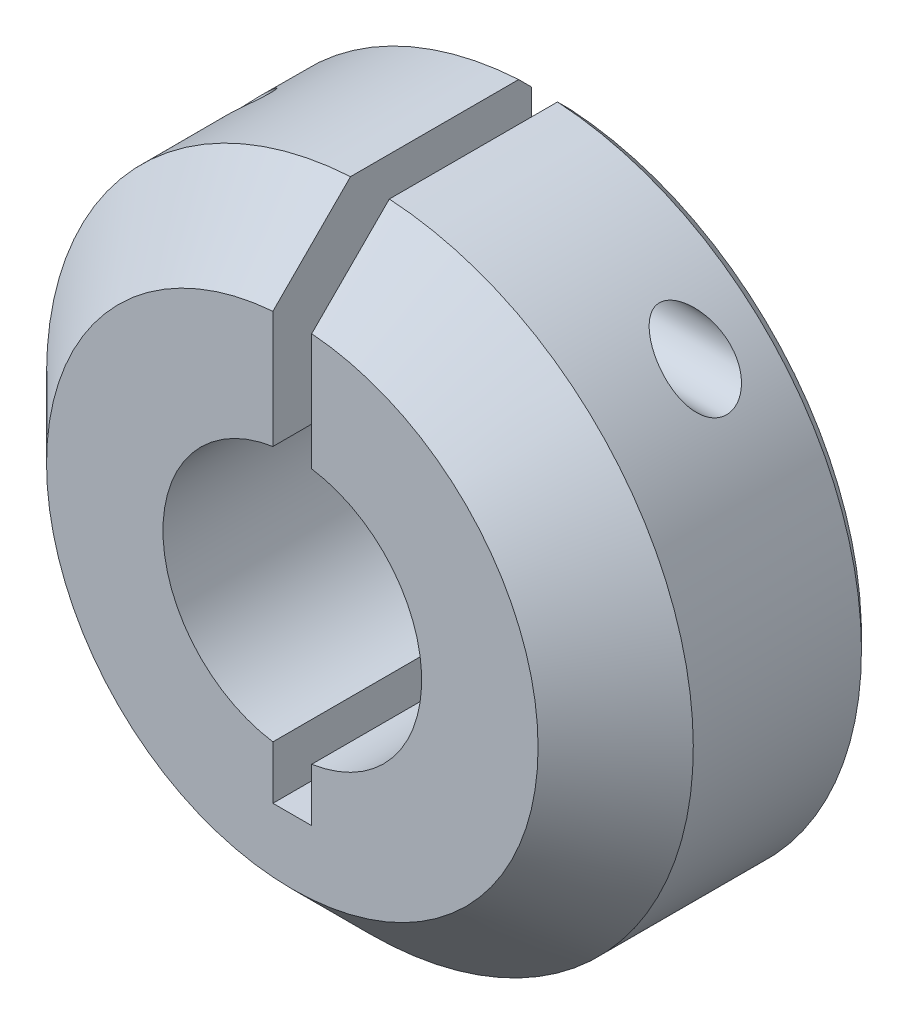
ISO-10303-21;
HEADER;
FILE_DESCRIPTION(('STEP AP214'),'2;1');
FILE_NAME('part.step','',(''),(''),'','','');
FILE_SCHEMA(('AUTOMOTIVE_DESIGN { 1 0 10303 214 1 1 1 1 }'));
ENDSEC;
DATA;
#1=APPLICATION_CONTEXT('core data for automotive mechanical design processes');
#2=APPLICATION_PROTOCOL_DEFINITION('international standard','automotive_design',2000,#1);
#3=PRODUCT_CONTEXT('',#1,'mechanical');
#4=PRODUCT('Part','Part','',(#3));
#5=PRODUCT_RELATED_PRODUCT_CATEGORY('part','',(#4));
#6=PRODUCT_DEFINITION_FORMATION('','',#4);
#7=PRODUCT_DEFINITION_CONTEXT('part definition',#1,'design');
#8=PRODUCT_DEFINITION('design','',#6,#7);
#9=PRODUCT_DEFINITION_SHAPE('','',#8);
#10=(LENGTH_UNIT() NAMED_UNIT(*) SI_UNIT(.MILLI.,.METRE.));
#11=(NAMED_UNIT(*) PLANE_ANGLE_UNIT() SI_UNIT($,.RADIAN.));
#12=(NAMED_UNIT(*) SI_UNIT($,.STERADIAN.) SOLID_ANGLE_UNIT());
#13=UNCERTAINTY_MEASURE_WITH_UNIT(LENGTH_MEASURE(1.E-05),#10,'distance_accuracy_value','');
#14=(GEOMETRIC_REPRESENTATION_CONTEXT(3) GLOBAL_UNCERTAINTY_ASSIGNED_CONTEXT((#13)) GLOBAL_UNIT_ASSIGNED_CONTEXT((#10,
#11,#12)) REPRESENTATION_CONTEXT('',''));
#15=CARTESIAN_POINT('',(0.,0.,0.));
#16=DIRECTION('',(0.,0.,1.));
#17=DIRECTION('',(1.,0.,0.));
#18=AXIS2_PLACEMENT_3D('',#15,#16,#17);
#19=CARTESIAN_POINT('',(0.,0.,10.));
#20=DIRECTION('',(0.,0.,-1.));
#21=DIRECTION('',(-1.,0.,0.));
#22=AXIS2_PLACEMENT_3D('',#19,#20,#21);
#23=CYLINDRICAL_SURFACE('',#22,5.);
#24=CARTESIAN_POINT('',(0.,0.,0.));
#25=DIRECTION('',(0.,0.,-1.));
#26=DIRECTION('',(1.,0.,0.));
#27=AXIS2_PLACEMENT_3D('',#24,#25,#26);
#28=CIRCLE('',#27,5.);
#29=CARTESIAN_POINT('',(0.750000000000001,4.9434299833213,0.));
#30=VERTEX_POINT('',#29);
#31=CARTESIAN_POINT('',(0.750000000000001,-4.9434299833213,0.));
#32=VERTEX_POINT('',#31);
#33=EDGE_CURVE('E137',#30,#32,#28,.T.);
#34=ORIENTED_EDGE('',*,*,#33,.T.);
#35=DIRECTION('',(0.,0.,-1.));
#36=VECTOR('',#35,1.);
#37=CARTESIAN_POINT('',(0.750000000000001,-4.9434299833213,10.));
#38=LINE('',#37,#36);
#39=CARTESIAN_POINT('',(0.750000000000001,-4.9434299833213,10.));
#40=VERTEX_POINT('',#39);
#41=EDGE_CURVE('E116',#40,#32,#38,.T.);
#42=ORIENTED_EDGE('',*,*,#41,.F.);
#43=CARTESIAN_POINT('',(0.,0.,10.));
#44=DIRECTION('',(0.,0.,-1.));
#45=DIRECTION('',(1.,0.,0.));
#46=AXIS2_PLACEMENT_3D('',#43,#44,#45);
#47=CIRCLE('',#46,5.);
#48=CARTESIAN_POINT('',(0.750000000000001,4.9434299833213,10.));
#49=VERTEX_POINT('',#48);
#50=EDGE_CURVE('E123',#49,#40,#47,.T.);
#51=ORIENTED_EDGE('',*,*,#50,.F.);
#52=DIRECTION('',(0.,0.,-1.));
#53=VECTOR('',#52,1.);
#54=CARTESIAN_POINT('',(0.750000000000001,4.9434299833213,10.));
#55=LINE('',#54,#53);
#56=EDGE_CURVE('E212',#49,#30,#55,.T.);
#57=ORIENTED_EDGE('',*,*,#56,.T.);
#58=EDGE_LOOP('',(#34,#42,#51,#57));
#59=FACE_BOUND('',#58,.T.);
#60=ADVANCED_FACE('F33',(#59),#23,.F.);
#61=CARTESIAN_POINT('',(0.750000000000001,-4.9434299833213,10.));
#62=DIRECTION('',(1.,0.,0.));
#63=DIRECTION('',(0.,1.,0.));
#64=AXIS2_PLACEMENT_3D('',#61,#62,#63);
#65=PLANE('',#64);
#66=DIRECTION('',(0.,-1.,0.));
#67=VECTOR('',#66,1.);
#68=CARTESIAN_POINT('',(0.750000000000001,-4.9434299833213,0.));
#69=LINE('',#68,#67);
#70=CARTESIAN_POINT('',(0.750000000000001,-7.,0.));
#71=VERTEX_POINT('',#70);
#72=EDGE_CURVE('E220',#32,#71,#69,.T.);
#73=ORIENTED_EDGE('',*,*,#72,.T.);
#74=DIRECTION('',(0.,0.,-1.));
#75=VECTOR('',#74,1.);
#76=CARTESIAN_POINT('',(0.750000000000001,-7.,10.));
#77=LINE('',#76,#75);
#78=CARTESIAN_POINT('',(0.750000000000001,-7.,10.));
#79=VERTEX_POINT('',#78);
#80=EDGE_CURVE('E119',#79,#71,#77,.T.);
#81=ORIENTED_EDGE('',*,*,#80,.F.);
#82=DIRECTION('',(0.,-1.,0.));
#83=VECTOR('',#82,1.);
#84=CARTESIAN_POINT('',(0.750000000000001,-4.9434299833213,10.));
#85=LINE('',#84,#83);
#86=EDGE_CURVE('E112',#40,#79,#85,.T.);
#87=ORIENTED_EDGE('',*,*,#86,.F.);
#88=ORIENTED_EDGE('',*,*,#41,.T.);
#89=EDGE_LOOP('',(#73,#81,#87,#88));
#90=FACE_BOUND('',#89,.T.);
#91=ADVANCED_FACE('F114',(#90),#65,.F.);
#92=CARTESIAN_POINT('',(-0.749999999999999,-7.,10.));
#93=DIRECTION('',(0.,-1.,0.));
#94=DIRECTION('',(0.,0.,-1.));
#95=AXIS2_PLACEMENT_3D('',#92,#93,#94);
#96=PLANE('',#95);
#97=DIRECTION('',(-1.,0.,0.));
#98=VECTOR('',#97,1.);
#99=CARTESIAN_POINT('',(-0.749999999999999,-7.,0.));
#100=LINE('',#99,#98);
#101=CARTESIAN_POINT('',(-0.749999999999999,-7.,0.));
#102=VERTEX_POINT('',#101);
#103=EDGE_CURVE('E222',#71,#102,#100,.T.);
#104=ORIENTED_EDGE('',*,*,#103,.T.);
#105=DIRECTION('',(0.,0.,-1.));
#106=VECTOR('',#105,1.);
#107=CARTESIAN_POINT('',(-0.749999999999999,-7.,10.));
#108=LINE('',#107,#106);
#109=CARTESIAN_POINT('',(-0.749999999999999,-7.,10.));
#110=VERTEX_POINT('',#109);
#111=EDGE_CURVE('E142',#110,#102,#108,.T.);
#112=ORIENTED_EDGE('',*,*,#111,.F.);
#113=DIRECTION('',(-1.,0.,0.));
#114=VECTOR('',#113,1.);
#115=CARTESIAN_POINT('',(-0.749999999999999,-7.,10.));
#116=LINE('',#115,#114);
#117=EDGE_CURVE('E122',#79,#110,#116,.T.);
#118=ORIENTED_EDGE('',*,*,#117,.F.);
#119=ORIENTED_EDGE('',*,*,#80,.T.);
#120=EDGE_LOOP('',(#104,#112,#118,#119));
#121=FACE_BOUND('',#120,.T.);
#122=ADVANCED_FACE('F263',(#121),#96,.F.);
#123=CARTESIAN_POINT('',(-0.749999999999999,-4.9434299833213,10.));
#124=DIRECTION('',(-1.,0.,0.));
#125=DIRECTION('',(0.,-1.,0.));
#126=AXIS2_PLACEMENT_3D('',#123,#124,#125);
#127=PLANE('',#126);
#128=DIRECTION('',(0.,1.,0.));
#129=VECTOR('',#128,1.);
#130=CARTESIAN_POINT('',(-0.749999999999999,-4.9434299833213,0.));
#131=LINE('',#130,#129);
#132=CARTESIAN_POINT('',(-0.750000000000003,-4.9434299833213,0.));
#133=VERTEX_POINT('',#132);
#134=EDGE_CURVE('E224',#102,#133,#131,.T.);
#135=ORIENTED_EDGE('',*,*,#134,.T.);
#136=DIRECTION('',(0.,0.,-1.));
#137=VECTOR('',#136,1.);
#138=CARTESIAN_POINT('',(-0.750000000000003,-4.9434299833213,10.));
#139=LINE('',#138,#137);
#140=CARTESIAN_POINT('',(-0.750000000000003,-4.9434299833213,10.));
#141=VERTEX_POINT('',#140);
#142=EDGE_CURVE('E234',#141,#133,#139,.T.);
#143=ORIENTED_EDGE('',*,*,#142,.F.);
#144=DIRECTION('',(0.,1.,0.));
#145=VECTOR('',#144,1.);
#146=CARTESIAN_POINT('',(-0.749999999999999,-4.9434299833213,10.));
#147=LINE('',#146,#145);
#148=EDGE_CURVE('E243',#110,#141,#147,.T.);
#149=ORIENTED_EDGE('',*,*,#148,.F.);
#150=ORIENTED_EDGE('',*,*,#111,.T.);
#151=EDGE_LOOP('',(#135,#143,#149,#150));
#152=FACE_BOUND('',#151,.T.);
#153=ADVANCED_FACE('F241',(#152),#127,.F.);
#154=CARTESIAN_POINT('',(0.,0.,10.));
#155=DIRECTION('',(0.,0.,-1.));
#156=DIRECTION('',(-1.,0.,0.));
#157=AXIS2_PLACEMENT_3D('',#154,#155,#156);
#158=CYLINDRICAL_SURFACE('',#157,5.);
#159=CARTESIAN_POINT('',(0.,0.,0.));
#160=DIRECTION('',(0.,0.,-1.));
#161=DIRECTION('',(1.,0.,0.));
#162=AXIS2_PLACEMENT_3D('',#159,#160,#161);
#163=CIRCLE('',#162,5.);
#164=CARTESIAN_POINT('',(-0.749999999999999,4.9434299833213,0.));
#165=VERTEX_POINT('',#164);
#166=EDGE_CURVE('E226',#133,#165,#163,.T.);
#167=ORIENTED_EDGE('',*,*,#166,.T.);
#168=DIRECTION('',(0.,0.,-1.));
#169=VECTOR('',#168,1.);
#170=CARTESIAN_POINT('',(-0.749999999999999,4.9434299833213,10.));
#171=LINE('',#170,#169);
#172=CARTESIAN_POINT('',(-0.749999999999999,4.9434299833213,10.));
#173=VERTEX_POINT('',#172);
#174=EDGE_CURVE('E208',#173,#165,#171,.T.);
#175=ORIENTED_EDGE('',*,*,#174,.F.);
#176=CARTESIAN_POINT('',(0.,0.,10.));
#177=DIRECTION('',(0.,0.,-1.));
#178=DIRECTION('',(1.,0.,0.));
#179=AXIS2_PLACEMENT_3D('',#176,#177,#178);
#180=CIRCLE('',#179,5.);
#181=EDGE_CURVE('E215',#141,#173,#180,.T.);
#182=ORIENTED_EDGE('',*,*,#181,.F.);
#183=ORIENTED_EDGE('',*,*,#142,.T.);
#184=EDGE_LOOP('',(#167,#175,#182,#183));
#185=FACE_BOUND('',#184,.T.);
#186=ADVANCED_FACE('F186',(#185),#158,.F.);
#187=CARTESIAN_POINT('',(-0.749999999999999,4.9434299833213,10.));
#188=DIRECTION('',(-1.,0.,0.));
#189=DIRECTION('',(0.,-1.,0.));
#190=AXIS2_PLACEMENT_3D('',#187,#188,#189);
#191=PLANE('',#190);
#192=CARTESIAN_POINT('',(-0.749999999999999,9.,3.));
#193=DIRECTION('',(-1.,0.,0.));
#194=DIRECTION('',(0.,-1.,0.));
#195=AXIS2_PLACEMENT_3D('',#192,#193,#194);
#196=CIRCLE('',#195,0.725);
#197=CARTESIAN_POINT('',(-0.749999999999999,8.275,3.));
#198=VERTEX_POINT('',#197);
#199=EDGE_CURVE('E356',#198,#198,#196,.T.);
#200=ORIENTED_EDGE('',*,*,#199,.T.);
#201=EDGE_LOOP('',(#200));
#202=FACE_BOUND('',#201,.T.);
#203=DIRECTION('',(0.,1.,0.));
#204=VECTOR('',#203,1.);
#205=CARTESIAN_POINT('',(-0.749999999999999,4.9434299833213,0.));
#206=LINE('',#205,#204);
#207=CARTESIAN_POINT('',(-0.749999999999999,11.9765395670035,0.));
#208=VERTEX_POINT('',#207);
#209=EDGE_CURVE('E228',#165,#208,#206,.T.);
#210=ORIENTED_EDGE('',*,*,#209,.T.);
#211=CARTESIAN_POINT('',(-0.749999999999999,11.9765395670035,0.));
#212=CARTESIAN_POINT('',(-0.749999999999999,12.0600327921926,0.0833301265377385));
#213=CARTESIAN_POINT('',(-0.749999999999999,12.1435244169929,0.166661856473588));
#214=CARTESIAN_POINT('',(-0.749999999999999,12.3105044658143,0.333328523140256));
#215=CARTESIAN_POINT('',(-0.749999999999999,12.3939928898355,0.416663459871074));
#216=CARTESIAN_POINT('',(-0.749999999999999,12.4774797134678,0.500000000000004));
#217=B_SPLINE_CURVE_WITH_KNOTS('',3,(#211,#212,#213,#214,#215,#216),.UNSPECIFIED.,.F.,.F.,(4,2,
4),(0.,0.353885938733081,0.707771877460835),.UNSPECIFIED.);
#218=CARTESIAN_POINT('',(-0.749999999999999,12.4774797134678,0.500000000000004));
#219=VERTEX_POINT('',#218);
#220=EDGE_CURVE('E11',#208,#219,#217,.T.);
#221=ORIENTED_EDGE('',*,*,#220,.T.);
#222=DIRECTION('',(0.,0.,-1.));
#223=VECTOR('',#222,1.);
#224=CARTESIAN_POINT('',(-0.749999999999999,12.4774797134678,10.));
#225=LINE('',#224,#223);
#226=CARTESIAN_POINT('',(-0.749999999999999,12.4774797134678,6.99999999999998));
#227=VERTEX_POINT('',#226);
#228=EDGE_CURVE('E203',#227,#219,#225,.T.);
#229=ORIENTED_EDGE('',*,*,#228,.F.);
#230=CARTESIAN_POINT('',(-0.749999999999999,12.4774797134678,6.99999999999998));
#231=CARTESIAN_POINT('',(-0.749999999999999,11.9764534394981,7.50016264999375));
#232=CARTESIAN_POINT('',(-0.749999999999999,11.4753460324942,8.00024397409326));
#233=CARTESIAN_POINT('',(-0.75,10.4729689488188,9.00024397409443));
#234=CARTESIAN_POINT('',(-0.75,9.97169927214604,9.50016264999493));
#235=CARTESIAN_POINT('',(-0.749999999999999,9.47034846243791,10.));
#236=B_SPLINE_CURVE_WITH_KNOTS('',3,(#230,#231,#232,#233,#234,#235),.UNSPECIFIED.,.F.,.F.,(4,2,
4),(0.,2.12384313841809,4.24768629208814),.UNSPECIFIED.);
#237=CARTESIAN_POINT('',(-0.749999999999999,9.4703484624379,10.));
#238=VERTEX_POINT('',#237);
#239=EDGE_CURVE('E190',#227,#238,#236,.T.);
#240=ORIENTED_EDGE('',*,*,#239,.T.);
#241=DIRECTION('',(0.,1.,0.));
#242=VECTOR('',#241,1.);
#243=CARTESIAN_POINT('',(-0.749999999999999,4.9434299833213,10.));
#244=LINE('',#243,#242);
#245=EDGE_CURVE('E211',#173,#238,#244,.T.);
#246=ORIENTED_EDGE('',*,*,#245,.F.);
#247=ORIENTED_EDGE('',*,*,#174,.T.);
#248=EDGE_LOOP('',(#210,#221,#229,#240,#246,#247));
#249=FACE_BOUND('',#248,.T.);
#250=ADVANCED_FACE('F182',(#202,#249),#191,.F.);
#251=CARTESIAN_POINT('',(0.,0.,10.));
#252=DIRECTION('',(0.,0.,-1.));
#253=DIRECTION('',(-1.,0.,0.));
#254=AXIS2_PLACEMENT_3D('',#251,#252,#253);
#255=CYLINDRICAL_SURFACE('',#254,12.5);
#256=CARTESIAN_POINT('',(-7.85330344504783,9.725,3.));
#257=CARTESIAN_POINT('',(-7.85330724966282,9.72499710166703,3.03049591517305));
#258=CARTESIAN_POINT('',(-7.85571767964799,9.72305192932455,3.06104722408714));
#259=CARTESIAN_POINT('',(-7.86508708886648,9.71547418285057,3.12100402933793));
#260=CARTESIAN_POINT('',(-7.87205932184832,9.70983086414133,3.1504059215886));
#261=CARTESIAN_POINT('',(-7.88974930812586,9.69546193886619,3.20687857289311));
#262=CARTESIAN_POINT('',(-7.90042811243029,9.68676837463444,3.23397005912363));
#263=CARTESIAN_POINT('',(-7.92474388514337,9.66688583469671,3.28576091243097));
#264=CARTESIAN_POINT('',(-7.93838121570186,9.65569655348811,3.31045998611943));
#265=CARTESIAN_POINT('',(-7.97589737590445,9.62475566155536,3.37008930555561));
#266=CARTESIAN_POINT('',(-8.00132779757763,9.60364489230904,3.40333418044508));
#267=CARTESIAN_POINT('',(-8.05564605484352,9.55812931500246,3.46429518527835));
#268=CARTESIAN_POINT('',(-8.08454349752005,9.53371532871557,3.49199535728557));
#269=CARTESIAN_POINT('',(-8.15938950174766,9.46983712499056,3.55476153792435));
#270=CARTESIAN_POINT('',(-8.20670337145852,9.42890066151729,3.58669612526895));
#271=CARTESIAN_POINT('',(-8.30376904511924,9.34353393390023,3.64043255352067));
#272=CARTESIAN_POINT('',(-8.35352338852479,9.2991000000703,3.662223581146));
#273=CARTESIAN_POINT('',(-8.45588916882334,9.20613318897957,3.69690939695554));
#274=CARTESIAN_POINT('',(-8.50853843078886,9.15750971063575,3.70944812371478));
#275=CARTESIAN_POINT('',(-8.61373339489862,9.05863168998092,3.72435203505037));
#276=CARTESIAN_POINT('',(-8.66627910839686,9.0083773384181,3.72671840510346));
#277=CARTESIAN_POINT('',(-8.76964682229392,8.90777424346779,3.72085532598516));
#278=CARTESIAN_POINT('',(-8.82048114474011,8.85743206191318,3.71273714850372));
#279=CARTESIAN_POINT('',(-8.91976173784721,8.75744183830774,3.68518198235305));
#280=CARTESIAN_POINT('',(-8.96821059177723,8.70779308902654,3.66575754347398));
#281=CARTESIAN_POINT('',(-9.04807825675744,8.62465252839502,3.62152777646508));
#282=CARTESIAN_POINT('',(-9.08048317150173,8.59051067874849,3.59972593807996));
#283=CARTESIAN_POINT('',(-9.14223986859575,8.52475633759282,3.54907672548391));
#284=CARTESIAN_POINT('',(-9.17159597381425,8.49314027989983,3.52023952656998));
#285=CARTESIAN_POINT('',(-9.21990080234129,8.4406402555048,3.46249795800548));
#286=CARTESIAN_POINT('',(-9.23970719667171,8.41893943109935,3.4350584539834));
#287=CARTESIAN_POINT('',(-9.27596766552569,8.3789706889845,3.37579290742236));
#288=CARTESIAN_POINT('',(-9.29242569965897,8.36069871848657,3.34397212156219));
#289=CARTESIAN_POINT('',(-9.31870774270352,8.33138694795417,3.28204653366979));
#290=CARTESIAN_POINT('',(-9.32918165237736,8.31964795424696,3.25255071288326));
#291=CARTESIAN_POINT('',(-9.3466947114695,8.29996822792607,3.19134174893574));
#292=CARTESIAN_POINT('',(-9.35373564887537,8.29202551814461,3.15962976987314));
#293=CARTESIAN_POINT('',(-9.36398884546344,8.28044532273691,3.09465455435827));
#294=CARTESIAN_POINT('',(-9.36718281394162,8.27682840498238,3.06138468239037));
#295=CARTESIAN_POINT('',(-9.36946061550331,8.27424989932699,2.99452524668271));
#296=CARTESIAN_POINT('',(-9.36854534560874,8.27528729541751,2.96093575431157));
#297=CARTESIAN_POINT('',(-9.36291135910865,8.28166079836362,2.89726124814134));
#298=CARTESIAN_POINT('',(-9.35850438569938,8.286644549488,2.86711161634526));
#299=CARTESIAN_POINT('',(-9.34652268548436,8.30015629540967,2.8082837809095));
#300=CARTESIAN_POINT('',(-9.3389477136398,8.30868456436854,2.77960569128355));
#301=CARTESIAN_POINT('',(-9.32058383649283,8.32928053236343,2.72303854263531));
#302=CARTESIAN_POINT('',(-9.30966428469156,8.34149172337805,2.69524488274574));
#303=CARTESIAN_POINT('',(-9.28522749986691,8.36868480237186,2.64229349023903));
#304=CARTESIAN_POINT('',(-9.27170880026225,8.38366825443163,2.61713725824581));
#305=CARTESIAN_POINT('',(-9.23576183598183,8.42328347489762,2.55865953619397));
#306=CARTESIAN_POINT('',(-9.21210417587027,8.44917306964944,2.5269407735812));
#307=CARTESIAN_POINT('',(-9.16137693091012,8.50415085386506,2.46958066790138));
#308=CARTESIAN_POINT('',(-9.13430017893837,8.53324574545813,2.44395242688183));
#309=CARTESIAN_POINT('',(-9.06774717178811,8.60401400992665,2.39056343180605));
#310=CARTESIAN_POINT('',(-9.02724754221942,8.64652626220679,2.36519467130258));
#311=CARTESIAN_POINT('',(-8.94335908696782,8.73326940513997,2.32413885814293));
#312=CARTESIAN_POINT('',(-8.89996677569394,8.77750234143882,2.30846372844709));
#313=CARTESIAN_POINT('',(-8.79884860484494,8.87900466426493,2.28274900273685));
#314=CARTESIAN_POINT('',(-8.74054284913965,8.93641932653513,2.27556144255526));
#315=CARTESIAN_POINT('',(-8.62269197986944,9.05018892381536,2.27450039416114));
#316=CARTESIAN_POINT('',(-8.56314487661866,9.10654182923619,2.28065021948222));
#317=CARTESIAN_POINT('',(-8.44382522571382,9.21729425149788,2.30597417354877));
#318=CARTESIAN_POINT('',(-8.38405675250525,9.2716674244989,2.32528281525728));
#319=CARTESIAN_POINT('',(-8.2669294158327,9.37624559331403,2.3775245537631));
#320=CARTESIAN_POINT('',(-8.2095641037396,9.42646215125229,2.41041822073855));
#321=CARTESIAN_POINT('',(-8.12486804904238,9.4993751853022,2.47329304866909));
#322=CARTESIAN_POINT('',(-8.09556564699048,9.52434621338786,2.49801401906077));
#323=CARTESIAN_POINT('',(-8.03963614062611,9.57160265826435,2.55256717275469));
#324=CARTESIAN_POINT('',(-8.01300551396537,9.59389161891724,2.58239248245056));
#325=CARTESIAN_POINT('',(-7.96955095450117,9.62999821298363,2.64000025421366));
#326=CARTESIAN_POINT('',(-7.95188365535221,9.64458267155879,2.66665868600134));
#327=CARTESIAN_POINT('',(-7.91993627052776,9.67083428606395,2.72327718777416));
#328=CARTESIAN_POINT('',(-7.90565204765813,9.68250500618666,2.75323315877881));
#329=CARTESIAN_POINT('',(-7.88423048162887,9.69995149186387,2.80931538712836));
#330=CARTESIAN_POINT('',(-7.87621660620066,9.70645540421614,2.83487813468237));
#331=CARTESIAN_POINT('',(-7.86359029425289,9.71668746119581,2.88733703910117));
#332=CARTESIAN_POINT('',(-7.85896868717037,9.72042308978856,2.91422938964206));
#333=CARTESIAN_POINT('',(-7.85526413993005,9.72341639070459,2.95111732093279));
#334=CARTESIAN_POINT('',(-7.85453044062364,9.72400905421673,2.96086747837151));
#335=CARTESIAN_POINT('',(-7.85354942478423,9.72480137069135,2.98040984496266));
#336=CARTESIAN_POINT('',(-7.85330222267506,9.72500093119627,2.99020206346522));
#337=CARTESIAN_POINT('',(-7.85330344504783,9.725,3.));
#338=B_SPLINE_CURVE_WITH_KNOTS('',3,(#256,#257,#258,#259,#260,#261,#262,#263,#264,#265,#266,
#267,#268,#269,#270,#271,#272,#273,#274,#275,#276,#277,#278,#279,#280,#281,#282,#283,#284,#285,
#286,#287,#288,#289,#290,#291,#292,#293,#294,#295,#296,#297,#298,#299,#300,#301,#302,#303,#304,
#305,#306,#307,#308,#309,#310,#311,#312,#313,#314,#315,#316,#317,#318,#319,#320,#321,#322,#323,
#324,#325,#326,#327,#328,#329,#330,#331,#332,#333,#334,#335,#336,#337),.UNSPECIFIED.,.T.,.F.,(4,
2,2,2,2,2,2,2,2,2,2,2,2,2,2,2,2,2,2,2,2,2,2,2,2,2,2,2,2,2,2,2,2,2,2,2,2,2,2,2,4),(0.,
0.0914377487787789,0.183142345292526,0.273911099842429,0.36469097156805,0.504535852411858,
0.644777603148032,0.854370982672379,1.06418728503384,1.28170822986543,1.49920382432634,
1.71441001308206,1.92937778031776,2.084499466964,2.23939811625978,2.35956508388759,
2.4795891111043,2.57946038249859,2.67927958244145,2.77957153016049,2.87984158581783,
2.97204917697678,3.06426390154147,3.16067785228938,3.25714636557066,3.39821932679486,
3.53959307405137,3.73043791535607,3.92151702731,4.16669489452387,4.4123016740477,
4.66045753395597,4.90789814063446,5.04482969176389,5.18157827849611,5.2866864938601,
5.39166549997609,5.47404871576193,5.55620839044931,5.58557922958107,5.61495697589018),.UNSPECIFIED.);
#339=CARTESIAN_POINT('',(-7.85330344504783,9.725,3.));
#340=VERTEX_POINT('',#339);
#341=EDGE_CURVE('E350',#340,#340,#338,.T.);
#342=ORIENTED_EDGE('',*,*,#341,.T.);
#343=EDGE_LOOP('',(#342));
#344=FACE_BOUND('',#343,.T.);
#345=CARTESIAN_POINT('',(7.19022774326377,10.225,3.));
#346=CARTESIAN_POINT('',(7.1902337212356,10.2249961462255,2.95033066014896));
#347=CARTESIAN_POINT('',(7.19459375594715,10.2219340277134,2.90054357292287));
#348=CARTESIAN_POINT('',(7.21142763723273,10.2100641014757,2.80300195516731));
#349=CARTESIAN_POINT('',(7.22393308754616,10.2012339135908,2.755256116718));
#350=CARTESIAN_POINT('',(7.25534688678666,10.178914556376,2.66388799914576));
#351=CARTESIAN_POINT('',(7.27416957946289,10.1654876678251,2.62022005218789));
#352=CARTESIAN_POINT('',(7.31668641464388,10.1349291110955,2.53681930271268));
#353=CARTESIAN_POINT('',(7.34038025993595,10.1177976689463,2.49708626032675));
#354=CARTESIAN_POINT('',(7.40768876744611,10.0687039376696,2.39727085617919));
#355=CARTESIAN_POINT('',(7.45433893933017,10.0342729567915,2.3404654015422));
#356=CARTESIAN_POINT('',(7.55343161501476,9.95989677277972,2.23623309812081));
#357=CARTESIAN_POINT('',(7.605892419077,9.91993404301417,2.1888372728581));
#358=CARTESIAN_POINT('',(7.70256158663024,9.8449704746191,2.11181425261968));
#359=CARTESIAN_POINT('',(7.74610806615348,9.81075963650012,2.08055973398176));
#360=CARTESIAN_POINT('',(7.8346486326892,9.74019994869955,2.02285798044264));
#361=CARTESIAN_POINT('',(7.87964350095698,9.70384993609536,1.99641339292815));
#362=CARTESIAN_POINT('',(8.01602893937684,9.59203033180061,1.92387885457653));
#363=CARTESIAN_POINT('',(8.10882658609318,9.51378636472544,1.88458336704095));
#364=CARTESIAN_POINT('',(8.2987654505862,9.34863526321756,1.82222244786502));
#365=CARTESIAN_POINT('',(8.39593651875849,9.26151073676397,1.79983893324274));
#366=CARTESIAN_POINT('',(8.58881381868407,9.08292318884688,1.77449305747784));
#367=CARTESIAN_POINT('',(8.68452108801874,8.99146344863142,1.77151623690575));
#368=CARTESIAN_POINT('',(8.85850067842916,8.81984594343063,1.78572349622679));
#369=CARTESIAN_POINT('',(8.9372866028473,8.73997560335181,1.80004269262454));
#370=CARTESIAN_POINT('',(9.09026592088364,8.58074465236137,1.84600763364363));
#371=CARTESIAN_POINT('',(9.16446492267988,8.50138352974787,1.8776317347649));
#372=CARTESIAN_POINT('',(9.28806044827051,8.36589165424778,1.9498307624006));
#373=CARTESIAN_POINT('',(9.33901017437881,8.30892671616804,1.98617145691305));
#374=CARTESIAN_POINT('',(9.43553122859726,8.19914994922179,2.07046424313889));
#375=CARTESIAN_POINT('',(9.4811101453728,8.14633229656731,2.118399652338));
#376=CARTESIAN_POINT('',(9.55659511060326,8.05755431900671,2.21525833338685));
#377=CARTESIAN_POINT('',(9.58780566095958,8.02034661882213,2.26201420429972));
#378=CARTESIAN_POINT('',(9.64459897899816,7.95196103433294,2.36286261934987));
#379=CARTESIAN_POINT('',(9.67018328338276,7.92078150382999,2.41695315362165));
#380=CARTESIAN_POINT('',(9.71473660424036,7.86607635973868,2.53209388682896));
#381=CARTESIAN_POINT('',(9.73364649190881,7.84261927650301,2.59320023308788));
#382=CARTESIAN_POINT('',(9.76339228541189,7.80555885664443,2.72018929799516));
#383=CARTESIAN_POINT('',(9.77423668298057,7.79194515685784,2.78606691277517));
#384=CARTESIAN_POINT('',(9.78618547292944,7.77693048659635,2.91024295612332));
#385=CARTESIAN_POINT('',(9.78847604508124,7.7740425393639,2.96825199319817));
#386=CARTESIAN_POINT('',(9.78651278153654,7.77651412176654,3.08397188222849));
#387=CARTESIAN_POINT('',(9.78226137351479,7.78187059196664,3.14168283682678));
#388=CARTESIAN_POINT('',(9.76792969108925,7.7998504536691,3.25130551928815));
#389=CARTESIAN_POINT('',(9.75824216707016,7.8119839655804,3.30335143596484));
#390=CARTESIAN_POINT('',(9.73377779848948,7.84244536509767,3.40431955790398));
#391=CARTESIAN_POINT('',(9.71900054701232,7.86077374797147,3.4532415130399));
#392=CARTESIAN_POINT('',(9.68385542307359,7.90403460496212,3.54996764315141));
#393=CARTESIAN_POINT('',(9.66319675598039,7.92930720766115,3.59751258139581));
#394=CARTESIAN_POINT('',(9.61750658642858,7.98466396947128,3.6873935462561));
#395=CARTESIAN_POINT('',(9.5924724742186,8.01475099925648,3.72972643829632));
#396=CARTESIAN_POINT('',(9.52717573805836,8.09237033701673,3.82590360375284));
#397=CARTESIAN_POINT('',(9.48499018655367,8.1418456726843,3.87688416604492));
#398=CARTESIAN_POINT('',(9.39490475222654,8.24563635510288,3.96764446270502));
#399=CARTESIAN_POINT('',(9.34699379481192,8.29996102882407,4.00740197247698));
#400=CARTESIAN_POINT('',(9.23050593461358,8.42956611681104,4.08755805157077));
#401=CARTESIAN_POINT('',(9.16029937970462,8.50588329116459,4.12390304866018));
#402=CARTESIAN_POINT('',(9.01491134152563,8.65983007571928,4.17967370247212));
#403=CARTESIAN_POINT('',(8.93972431104176,8.73746107511862,4.19908014030187));
#404=CARTESIAN_POINT('',(8.76412761202061,8.914014202474,4.22610757232455));
#405=CARTESIAN_POINT('',(8.66267244915045,9.01265207841365,4.2287472433991));
#406=CARTESIAN_POINT('',(8.45729970004711,9.20565063627402,4.21150766554364));
#407=CARTESIAN_POINT('',(8.35337708331112,9.30000118652211,4.19157769448724));
#408=CARTESIAN_POINT('',(8.19734438944799,9.43707896891735,4.1454015737004));
#409=CARTESIAN_POINT('',(8.1449614750676,9.48231450713154,4.12711964319948));
#410=CARTESIAN_POINT('',(8.04078410081027,9.57081227473656,4.0849888488539));
#411=CARTESIAN_POINT('',(7.98898937590897,9.61407542166926,4.06114260573564));
#412=CARTESIAN_POINT('',(7.88665348386363,9.69819953005167,4.00777848162905));
#413=CARTESIAN_POINT('',(7.83610918664493,9.73906693718783,3.97827682618743));
#414=CARTESIAN_POINT('',(7.73687506909483,9.81808422005478,3.91322529570959));
#415=CARTESIAN_POINT('',(7.68818351595043,9.85623666559605,3.87768125101556));
#416=CARTESIAN_POINT('',(7.59582764602764,9.92757010595142,3.8017648693288));
#417=CARTESIAN_POINT('',(7.55203506562469,9.96089916976849,3.76169047177414));
#418=CARTESIAN_POINT('',(7.46843126414379,10.023734708679,3.67487779075993));
#419=CARTESIAN_POINT('',(7.42861673231949,10.0532443686319,3.62814512859818));
#420=CARTESIAN_POINT('',(7.36199959391367,10.1020958311205,3.53681116636107));
#421=CARTESIAN_POINT('',(7.33415622076975,10.1223070121408,3.49344703789042));
#422=CARTESIAN_POINT('',(7.28424522401828,10.1582831966745,3.40176709041071));
#423=CARTESIAN_POINT('',(7.26216957169509,10.1740543830956,3.35345828630408));
#424=CARTESIAN_POINT('',(7.23012562864389,10.1968416224805,3.26419579391682));
#425=CARTESIAN_POINT('',(7.21853740629644,10.2050393997263,3.22412965903811));
#426=CARTESIAN_POINT('',(7.20101125295558,10.2174143323871,3.14222806742085));
#427=CARTESIAN_POINT('',(7.19505628516711,10.2216036112502,3.10039834779386));
#428=CARTESIAN_POINT('',(7.19154477503144,10.2240737315128,3.04861927153065));
#429=CARTESIAN_POINT('',(7.19105176455035,10.2244205142137,3.03890677387595));
#430=CARTESIAN_POINT('',(7.19039263977485,10.2248840423504,3.01946435988773));
#431=CARTESIAN_POINT('',(7.19022657167148,10.2250007552817,3.00973444128729));
#432=CARTESIAN_POINT('',(7.19022774326377,10.225,3.));
#433=B_SPLINE_CURVE_WITH_KNOTS('',3,(#345,#346,#347,#348,#349,#350,#351,#352,#353,#354,#355,
#356,#357,#358,#359,#360,#361,#362,#363,#364,#365,#366,#367,#368,#369,#370,#371,#372,#373,#374,
#375,#376,#377,#378,#379,#380,#381,#382,#383,#384,#385,#386,#387,#388,#389,#390,#391,#392,#393,
#394,#395,#396,#397,#398,#399,#400,#401,#402,#403,#404,#405,#406,#407,#408,#409,#410,#411,#412,
#413,#414,#415,#416,#417,#418,#419,#420,#421,#422,#423,#424,#425,#426,#427,#428,#429,#430,#431,
#432),.UNSPECIFIED.,.T.,.F.,(4,2,2,2,2,2,2,2,2,2,2,2,2,2,2,2,2,2,2,2,2,2,2,2,2,2,2,2,2,2,2,2,2,
2,2,2,2,2,2,2,2,2,2,4),(0.,0.148952858939073,0.298487116833296,0.446070647876154,
0.593645176801435,0.835792147717929,1.07872468141905,1.26923777913495,1.45985542005543,
1.84106340018111,2.23692440787069,2.63249043594567,2.97061451280079,3.30831665626774,
3.56132053276973,3.81396252943509,4.0154233828418,4.21682914250773,4.41997684176539,
4.62291035344611,4.79636055447848,4.96974640509575,5.13197329679042,5.29421316127722,
5.4665542415689,5.63899846836877,5.88549840179963,6.13248309939988,6.46034826291617,
6.78858494827374,7.21103146007193,7.63442924888013,7.84898786179273,8.06344562334947,
8.27729706668455,8.4909433225347,8.69474532048649,8.89837626533317,9.06390777130005,
9.22920761336199,9.3562263940862,9.48285978884692,9.51204817856513,9.54124069177881),.UNSPECIFIED.);
#434=CARTESIAN_POINT('',(7.19022774326377,10.225,3.));
#435=VERTEX_POINT('',#434);
#436=EDGE_CURVE('E178',#435,#435,#433,.T.);
#437=ORIENTED_EDGE('',*,*,#436,.T.);
#438=EDGE_LOOP('',(#437));
#439=FACE_BOUND('',#438,.T.);
#440=ORIENTED_EDGE('',*,*,#228,.T.);
#441=CARTESIAN_POINT('',(0.,0.,0.500000000000004));
#442=DIRECTION('',(0.,0.,1.));
#443=DIRECTION('',(1.,0.,0.));
#444=AXIS2_PLACEMENT_3D('',#441,#442,#443);
#445=CIRCLE('',#444,12.5);
#446=CARTESIAN_POINT('',(0.750000000000001,12.4774797134678,0.500000000000004));
#447=VERTEX_POINT('',#446);
#448=EDGE_CURVE('E174',#219,#447,#445,.T.);
#449=ORIENTED_EDGE('',*,*,#448,.T.);
#450=DIRECTION('',(0.,0.,-1.));
#451=VECTOR('',#450,1.);
#452=CARTESIAN_POINT('',(0.750000000000001,12.4774797134678,10.));
#453=LINE('',#452,#451);
#454=CARTESIAN_POINT('',(0.750000000000001,12.4774797134678,6.99999999999998));
#455=VERTEX_POINT('',#454);
#456=EDGE_CURVE('E205',#455,#447,#453,.T.);
#457=ORIENTED_EDGE('',*,*,#456,.F.);
#458=CARTESIAN_POINT('',(0.,0.,6.99999999999998));
#459=DIRECTION('',(0.,0.,1.));
#460=DIRECTION('',(1.,0.,0.));
#461=AXIS2_PLACEMENT_3D('',#458,#459,#460);
#462=CIRCLE('',#461,12.5);
#463=EDGE_CURVE('E151',#455,#227,#462,.F.);
#464=ORIENTED_EDGE('',*,*,#463,.T.);
#465=EDGE_LOOP('',(#440,#449,#457,#464));
#466=FACE_BOUND('',#465,.T.);
#467=ADVANCED_FACE('F161',(#344,#439,#466),#255,.T.);
#468=CARTESIAN_POINT('',(0.750000000000001,4.9434299833213,10.));
#469=DIRECTION('',(1.,0.,0.));
#470=DIRECTION('',(0.,0.,-1.));
#471=AXIS2_PLACEMENT_3D('',#468,#469,#470);
#472=PLANE('',#471);
#473=CARTESIAN_POINT('',(0.750000000000001,9.,3.));
#474=DIRECTION('',(1.,0.,0.));
#475=DIRECTION('',(0.,0.,-1.));
#476=AXIS2_PLACEMENT_3D('',#473,#474,#475);
#477=CIRCLE('',#476,0.725);
#478=CARTESIAN_POINT('',(0.750000000000001,9.,2.275));
#479=VERTEX_POINT('',#478);
#480=EDGE_CURVE('E357',#479,#479,#477,.T.);
#481=ORIENTED_EDGE('',*,*,#480,.T.);
#482=EDGE_LOOP('',(#481));
#483=FACE_BOUND('',#482,.T.);
#484=ORIENTED_EDGE('',*,*,#456,.T.);
#485=CARTESIAN_POINT('',(0.750000000000001,12.4774797134678,0.500000000000004));
#486=CARTESIAN_POINT('',(0.750000000000001,12.3939928898355,0.416663459871074));
#487=CARTESIAN_POINT('',(0.750000000000001,12.3105044658143,0.333328523140256));
#488=CARTESIAN_POINT('',(0.750000000000001,12.1435244169929,0.166661856473588));
#489=CARTESIAN_POINT('',(0.750000000000001,12.0600327921926,0.0833301265377384));
#490=CARTESIAN_POINT('',(0.750000000000001,11.9765395670035,0.));
#491=B_SPLINE_CURVE_WITH_KNOTS('',3,(#485,#486,#487,#488,#489,#490),.UNSPECIFIED.,.F.,.F.,(4,2,
4),(0.,0.353885938727755,0.707771877460836),.UNSPECIFIED.);
#492=CARTESIAN_POINT('',(0.750000000000001,11.9765395670035,0.));
#493=VERTEX_POINT('',#492);
#494=EDGE_CURVE('E58',#447,#493,#491,.T.);
#495=ORIENTED_EDGE('',*,*,#494,.T.);
#496=DIRECTION('',(0.,-1.,0.));
#497=VECTOR('',#496,1.);
#498=CARTESIAN_POINT('',(0.750000000000001,4.9434299833213,0.));
#499=LINE('',#498,#497);
#500=EDGE_CURVE('E134',#493,#30,#499,.T.);
#501=ORIENTED_EDGE('',*,*,#500,.T.);
#502=ORIENTED_EDGE('',*,*,#56,.F.);
#503=DIRECTION('',(0.,-1.,0.));
#504=VECTOR('',#503,1.);
#505=CARTESIAN_POINT('',(0.750000000000001,4.9434299833213,10.));
#506=LINE('',#505,#504);
#507=CARTESIAN_POINT('',(0.750000000000001,9.4703484624379,10.));
#508=VERTEX_POINT('',#507);
#509=EDGE_CURVE('E130',#508,#49,#506,.T.);
#510=ORIENTED_EDGE('',*,*,#509,.F.);
#511=CARTESIAN_POINT('',(0.750000000000001,9.47034846243791,10.));
#512=CARTESIAN_POINT('',(0.750000000000001,9.97169927214604,9.50016264999493));
#513=CARTESIAN_POINT('',(0.750000000000001,10.4729689488188,9.00024397409444));
#514=CARTESIAN_POINT('',(0.750000000000001,11.4753460324942,8.00024397409326));
#515=CARTESIAN_POINT('',(0.750000000000001,11.9764534394981,7.50016264999375));
#516=CARTESIAN_POINT('',(0.750000000000001,12.4774797134678,6.99999999999999));
#517=B_SPLINE_CURVE_WITH_KNOTS('',3,(#511,#512,#513,#514,#515,#516),.UNSPECIFIED.,.F.,.F.,(4,2,
4),(0.,2.12384315367005,4.24768629208814),.UNSPECIFIED.);
#518=EDGE_CURVE('E140',#508,#455,#517,.T.);
#519=ORIENTED_EDGE('',*,*,#518,.T.);
#520=EDGE_LOOP('',(#484,#495,#501,#502,#510,#519));
#521=FACE_BOUND('',#520,.T.);
#522=ADVANCED_FACE('F156',(#483,#521),#472,.F.);
#523=CARTESIAN_POINT('',(0.,0.,10.));
#524=DIRECTION('',(0.,0.,1.));
#525=DIRECTION('',(1.,0.,0.));
#526=AXIS2_PLACEMENT_3D('',#523,#524,#525);
#527=PLANE('',#526);
#528=ORIENTED_EDGE('',*,*,#245,.T.);
#529=CARTESIAN_POINT('',(0.,0.,10.));
#530=DIRECTION('',(0.,0.,1.));
#531=DIRECTION('',(1.,0.,0.));
#532=AXIS2_PLACEMENT_3D('',#529,#530,#531);
#533=CIRCLE('',#532,9.5);
#534=EDGE_CURVE('E138',#238,#508,#533,.T.);
#535=ORIENTED_EDGE('',*,*,#534,.T.);
#536=ORIENTED_EDGE('',*,*,#509,.T.);
#537=ORIENTED_EDGE('',*,*,#50,.T.);
#538=ORIENTED_EDGE('',*,*,#86,.T.);
#539=ORIENTED_EDGE('',*,*,#117,.T.);
#540=ORIENTED_EDGE('',*,*,#148,.T.);
#541=ORIENTED_EDGE('',*,*,#181,.T.);
#542=EDGE_LOOP('',(#528,#535,#536,#537,#538,#539,#540,#541));
#543=FACE_BOUND('',#542,.T.);
#544=ADVANCED_FACE('F127',(#543),#527,.T.);
#545=CARTESIAN_POINT('',(0.,0.,0.));
#546=DIRECTION('',(0.,0.,1.));
#547=DIRECTION('',(1.,0.,0.));
#548=AXIS2_PLACEMENT_3D('',#545,#546,#547);
#549=PLANE('',#548);
#550=ORIENTED_EDGE('',*,*,#500,.F.);
#551=CARTESIAN_POINT('',(0.,0.,0.));
#552=DIRECTION('',(0.,0.,1.));
#553=DIRECTION('',(1.,0.,0.));
#554=AXIS2_PLACEMENT_3D('',#551,#552,#553);
#555=CIRCLE('',#554,12.);
#556=EDGE_CURVE('E43',#493,#208,#555,.F.);
#557=ORIENTED_EDGE('',*,*,#556,.T.);
#558=ORIENTED_EDGE('',*,*,#209,.F.);
#559=ORIENTED_EDGE('',*,*,#166,.F.);
#560=ORIENTED_EDGE('',*,*,#134,.F.);
#561=ORIENTED_EDGE('',*,*,#103,.F.);
#562=ORIENTED_EDGE('',*,*,#72,.F.);
#563=ORIENTED_EDGE('',*,*,#33,.F.);
#564=EDGE_LOOP('',(#550,#557,#558,#559,#560,#561,#562,#563));
#565=FACE_BOUND('',#564,.T.);
#566=ADVANCED_FACE('F163',(#565),#549,.F.);
#567=CARTESIAN_POINT('',(0.,0.,10.));
#568=DIRECTION('',(0.,0.,-1.));
#569=DIRECTION('',(-1.,0.,0.));
#570=AXIS2_PLACEMENT_3D('',#567,#568,#569);
#571=CONICAL_SURFACE('',#570,9.5,0.785398163397446);
#572=ORIENTED_EDGE('',*,*,#239,.F.);
#573=ORIENTED_EDGE('',*,*,#463,.F.);
#574=ORIENTED_EDGE('',*,*,#518,.F.);
#575=ORIENTED_EDGE('',*,*,#534,.F.);
#576=EDGE_LOOP('',(#572,#573,#574,#575));
#577=FACE_BOUND('',#576,.T.);
#578=ADVANCED_FACE('F153',(#577),#571,.T.);
#579=CARTESIAN_POINT('',(0.,0.,0.500000000000004));
#580=DIRECTION('',(0.,0.,1.));
#581=DIRECTION('',(1.,0.,0.));
#582=AXIS2_PLACEMENT_3D('',#579,#580,#581);
#583=CONICAL_SURFACE('',#582,12.5,0.78539816339745);
#584=ORIENTED_EDGE('',*,*,#220,.F.);
#585=ORIENTED_EDGE('',*,*,#556,.F.);
#586=ORIENTED_EDGE('',*,*,#494,.F.);
#587=ORIENTED_EDGE('',*,*,#448,.F.);
#588=EDGE_LOOP('',(#584,#585,#586,#587));
#589=FACE_BOUND('',#588,.T.);
#590=ADVANCED_FACE('F35',(#589),#583,.T.);
#591=CARTESIAN_POINT('',(4.25,9.,3.));
#592=DIRECTION('',(1.,0.,0.));
#593=DIRECTION('',(0.,1.,0.));
#594=AXIS2_PLACEMENT_3D('',#591,#592,#593);
#595=CYLINDRICAL_SURFACE('',#594,1.225);
#596=CARTESIAN_POINT('',(4.25,9.,3.));
#597=DIRECTION('',(1.,0.,0.));
#598=DIRECTION('',(0.,1.,0.));
#599=AXIS2_PLACEMENT_3D('',#596,#597,#598);
#600=CIRCLE('',#599,1.225);
#601=CARTESIAN_POINT('',(4.25,10.225,3.));
#602=VERTEX_POINT('',#601);
#603=EDGE_CURVE('E360',#602,#602,#600,.T.);
#604=ORIENTED_EDGE('',*,*,#603,.F.);
#605=EDGE_LOOP('',(#604));
#606=FACE_BOUND('',#605,.T.);
#607=ORIENTED_EDGE('',*,*,#436,.F.);
#608=EDGE_LOOP('',(#607));
#609=FACE_BOUND('',#608,.T.);
#610=ADVANCED_FACE('F252',(#606,#609),#595,.F.);
#611=CARTESIAN_POINT('',(4.25,9.,3.));
#612=DIRECTION('',(1.,0.,0.));
#613=DIRECTION('',(0.,1.,0.));
#614=AXIS2_PLACEMENT_3D('',#611,#612,#613);
#615=PLANE('',#614);
#616=CARTESIAN_POINT('',(4.25,9.,3.));
#617=DIRECTION('',(1.,0.,0.));
#618=DIRECTION('',(0.,1.,0.));
#619=AXIS2_PLACEMENT_3D('',#616,#617,#618);
#620=CIRCLE('',#619,0.725);
#621=CARTESIAN_POINT('',(4.25,9.725,3.));
#622=VERTEX_POINT('',#621);
#623=EDGE_CURVE('E38',#622,#622,#620,.T.);
#624=ORIENTED_EDGE('',*,*,#623,.F.);
#625=EDGE_LOOP('',(#624));
#626=FACE_BOUND('',#625,.T.);
#627=ORIENTED_EDGE('',*,*,#603,.T.);
#628=EDGE_LOOP('',(#627));
#629=FACE_BOUND('',#628,.T.);
#630=ADVANCED_FACE('F257',(#626,#629),#615,.T.);
#631=CARTESIAN_POINT('',(-12.5,9.,3.));
#632=DIRECTION('',(1.,0.,0.));
#633=DIRECTION('',(0.,1.,0.));
#634=AXIS2_PLACEMENT_3D('',#631,#632,#633);
#635=CYLINDRICAL_SURFACE('',#634,0.725);
#636=ORIENTED_EDGE('',*,*,#623,.T.);
#637=EDGE_LOOP('',(#636));
#638=FACE_BOUND('',#637,.T.);
#639=ORIENTED_EDGE('',*,*,#480,.F.);
#640=EDGE_LOOP('',(#639));
#641=FACE_BOUND('',#640,.T.);
#642=ADVANCED_FACE('F323',(#638,#641),#635,.F.);
#643=ORIENTED_EDGE('',*,*,#341,.F.);
#644=EDGE_LOOP('',(#643));
#645=FACE_BOUND('',#644,.T.);
#646=ORIENTED_EDGE('',*,*,#199,.F.);
#647=EDGE_LOOP('',(#646));
#648=FACE_BOUND('',#647,.T.);
#649=ADVANCED_FACE('F332',(#645,#648),#635,.F.);
#650=CLOSED_SHELL('',(#60,#91,#122,#153,#186,#250,#467,#522,#544,#566,#578,#590,#610,#630,#642,#649));
#651=MANIFOLD_SOLID_BREP('B2',#650);
#652=ADVANCED_BREP_SHAPE_REPRESENTATION('',(#18,#651),#14);
#653=SHAPE_DEFINITION_REPRESENTATION(#9,#652);
ENDSEC;
END-ISO-10303-21;
